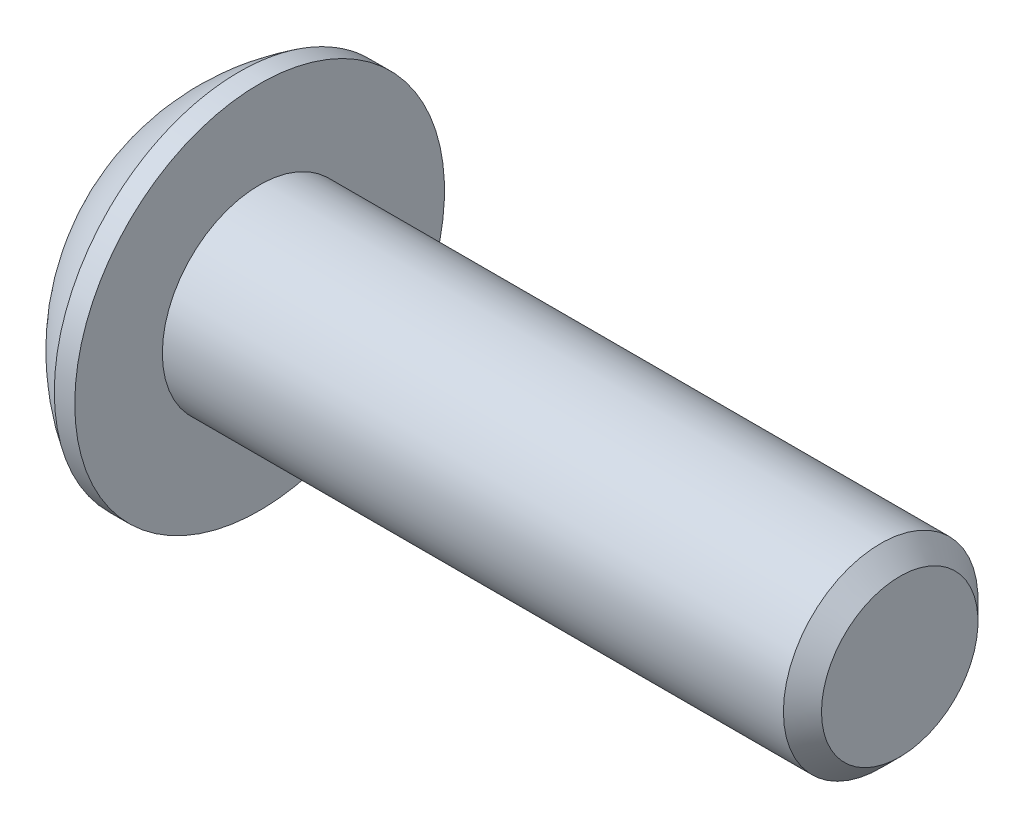
ISO-10303-21;
HEADER;
FILE_DESCRIPTION(('STEP AP214'),'2;1');
FILE_NAME('part.step','',(''),(''),'','','');
FILE_SCHEMA(('AUTOMOTIVE_DESIGN { 1 0 10303 214 1 1 1 1 }'));
ENDSEC;
DATA;
#1=APPLICATION_CONTEXT('core data for automotive mechanical design processes');
#2=APPLICATION_PROTOCOL_DEFINITION('international standard','automotive_design',2000,#1);
#3=PRODUCT_CONTEXT('',#1,'mechanical');
#4=PRODUCT('Part','Part','',(#3));
#5=PRODUCT_RELATED_PRODUCT_CATEGORY('part','',(#4));
#6=PRODUCT_DEFINITION_FORMATION('','',#4);
#7=PRODUCT_DEFINITION_CONTEXT('part definition',#1,'design');
#8=PRODUCT_DEFINITION('design','',#6,#7);
#9=PRODUCT_DEFINITION_SHAPE('','',#8);
#10=(LENGTH_UNIT() NAMED_UNIT(*) SI_UNIT(.MILLI.,.METRE.));
#11=(NAMED_UNIT(*) PLANE_ANGLE_UNIT() SI_UNIT($,.RADIAN.));
#12=(NAMED_UNIT(*) SI_UNIT($,.STERADIAN.) SOLID_ANGLE_UNIT());
#13=UNCERTAINTY_MEASURE_WITH_UNIT(LENGTH_MEASURE(1.E-05),#10,'distance_accuracy_value','');
#14=(GEOMETRIC_REPRESENTATION_CONTEXT(3) GLOBAL_UNCERTAINTY_ASSIGNED_CONTEXT((#13)) GLOBAL_UNIT_ASSIGNED_CONTEXT((#10,
#11,#12)) REPRESENTATION_CONTEXT('',''));
#15=CARTESIAN_POINT('',(0.,0.,0.));
#16=DIRECTION('',(0.,0.,1.));
#17=DIRECTION('',(1.,0.,0.));
#18=AXIS2_PLACEMENT_3D('',#15,#16,#17);
#19=CARTESIAN_POINT('',(1.77800000000006,0.,0.));
#20=DIRECTION('',(-1.,0.,0.));
#21=DIRECTION('',(0.,0.,1.));
#22=AXIS2_PLACEMENT_3D('',#19,#20,#21);
#23=CONICAL_SURFACE('',#22,1.58750000000007,1.04719755119647);
#24=CARTESIAN_POINT('',(2.69454355233878,0.,0.));
#25=VERTEX_POINT('',#24);
#26=VERTEX_LOOP('',#25);
#27=FACE_BOUND('',#26,.T.);
#28=CARTESIAN_POINT('',(1.77800000000006,0.,0.));
#29=DIRECTION('',(-1.,0.,0.));
#30=DIRECTION('',(0.,0.,1.));
#31=AXIS2_PLACEMENT_3D('',#28,#29,#30);
#32=CIRCLE('',#31,1.58750000000007);
#33=CARTESIAN_POINT('',(1.77800000000003,0.,1.58750000000004));
#34=VERTEX_POINT('',#33);
#35=CARTESIAN_POINT('',(1.77800000000003,-1.37481532850783,0.793750000000017));
#36=VERTEX_POINT('',#35);
#37=EDGE_CURVE('E19',#34,#36,#32,.F.);
#38=ORIENTED_EDGE('',*,*,#37,.F.);
#39=CARTESIAN_POINT('',(1.77800000000006,0.,0.));
#40=DIRECTION('',(-1.,0.,0.));
#41=DIRECTION('',(0.,0.,1.));
#42=AXIS2_PLACEMENT_3D('',#39,#40,#41);
#43=CIRCLE('',#42,1.58750000000007);
#44=CARTESIAN_POINT('',(1.77800000000003,1.37481532850783,0.793750000000019));
#45=VERTEX_POINT('',#44);
#46=EDGE_CURVE('E89',#34,#45,#43,.T.);
#47=ORIENTED_EDGE('',*,*,#46,.T.);
#48=CARTESIAN_POINT('',(1.77800000000006,0.,0.));
#49=DIRECTION('',(-1.,0.,0.));
#50=DIRECTION('',(0.,0.,1.));
#51=AXIS2_PLACEMENT_3D('',#48,#49,#50);
#52=CIRCLE('',#51,1.58750000000007);
#53=CARTESIAN_POINT('',(1.77800000000003,1.37481532850783,-0.793750000000019));
#54=VERTEX_POINT('',#53);
#55=EDGE_CURVE('E105',#45,#54,#52,.T.);
#56=ORIENTED_EDGE('',*,*,#55,.T.);
#57=CARTESIAN_POINT('',(1.77800000000006,0.,0.));
#58=DIRECTION('',(-1.,0.,0.));
#59=DIRECTION('',(0.,0.,1.));
#60=AXIS2_PLACEMENT_3D('',#57,#58,#59);
#61=CIRCLE('',#60,1.58750000000007);
#62=CARTESIAN_POINT('',(1.77800000000003,-2.78602967841758E-12,-1.58750000000004));
#63=VERTEX_POINT('',#62);
#64=EDGE_CURVE('E448',#54,#63,#61,.T.);
#65=ORIENTED_EDGE('',*,*,#64,.T.);
#66=CARTESIAN_POINT('',(1.77800000000006,0.,0.));
#67=DIRECTION('',(-1.,0.,0.));
#68=DIRECTION('',(0.,0.,1.));
#69=AXIS2_PLACEMENT_3D('',#66,#67,#68);
#70=CIRCLE('',#69,1.58750000000007);
#71=CARTESIAN_POINT('',(1.77800000000003,-1.37481532850783,-0.793750000000017));
#72=VERTEX_POINT('',#71);
#73=EDGE_CURVE('E450',#72,#63,#70,.F.);
#74=ORIENTED_EDGE('',*,*,#73,.F.);
#75=CARTESIAN_POINT('',(1.77800000000006,0.,0.));
#76=DIRECTION('',(-1.,0.,0.));
#77=DIRECTION('',(0.,0.,1.));
#78=AXIS2_PLACEMENT_3D('',#75,#76,#77);
#79=CIRCLE('',#78,1.58750000000007);
#80=EDGE_CURVE('E92',#36,#72,#79,.F.);
#81=ORIENTED_EDGE('',*,*,#80,.F.);
#82=EDGE_LOOP('',(#38,#47,#56,#65,#74,#81));
#83=FACE_BOUND('',#82,.T.);
#84=ADVANCED_FACE('F16',(#27,#83),#23,.F.);
#85=CARTESIAN_POINT('',(1.778,-2.74963065701559,-1.5875));
#86=DIRECTION('',(1.,0.,0.));
#87=DIRECTION('',(0.,0.,-1.));
#88=AXIS2_PLACEMENT_3D('',#85,#86,#87);
#89=PLANE('',#88);
#90=DIRECTION('',(0.,0.5,0.866025403784439));
#91=VECTOR('',#90,1.);
#92=CARTESIAN_POINT('',(1.778,-1.83308710467706,0.));
#93=LINE('',#92,#91);
#94=CARTESIAN_POINT('',(1.778,-0.91654355233853,1.5875));
#95=VERTEX_POINT('',#94);
#96=EDGE_CURVE('E110',#95,#36,#93,.F.);
#97=ORIENTED_EDGE('',*,*,#96,.F.);
#98=DIRECTION('',(0.,1.,0.));
#99=VECTOR('',#98,1.);
#100=CARTESIAN_POINT('',(1.778,-0.91654355233853,1.5875));
#101=LINE('',#100,#99);
#102=EDGE_CURVE('E108',#34,#95,#101,.F.);
#103=ORIENTED_EDGE('',*,*,#102,.F.);
#104=ORIENTED_EDGE('',*,*,#37,.T.);
#105=EDGE_LOOP('',(#97,#103,#104));
#106=FACE_BOUND('',#105,.T.);
#107=ADVANCED_FACE('F109',(#106),#89,.F.);
#108=CARTESIAN_POINT('',(1.778,-2.74963065701559,-1.5875));
#109=DIRECTION('',(1.,0.,0.));
#110=DIRECTION('',(0.,0.,-1.));
#111=AXIS2_PLACEMENT_3D('',#108,#109,#110);
#112=PLANE('',#111);
#113=DIRECTION('',(0.,-0.5,0.866025403784439));
#114=VECTOR('',#113,1.);
#115=CARTESIAN_POINT('',(1.778,-0.91654355233853,-1.5875));
#116=LINE('',#115,#114);
#117=CARTESIAN_POINT('',(1.778,-1.83308710467706,0.));
#118=VERTEX_POINT('',#117);
#119=EDGE_CURVE('E158',#118,#72,#116,.F.);
#120=ORIENTED_EDGE('',*,*,#119,.F.);
#121=DIRECTION('',(0.,0.5,0.866025403784439));
#122=VECTOR('',#121,1.);
#123=CARTESIAN_POINT('',(1.778,-1.83308710467706,0.));
#124=LINE('',#123,#122);
#125=EDGE_CURVE('E170',#36,#118,#124,.F.);
#126=ORIENTED_EDGE('',*,*,#125,.F.);
#127=ORIENTED_EDGE('',*,*,#80,.T.);
#128=EDGE_LOOP('',(#120,#126,#127));
#129=FACE_BOUND('',#128,.T.);
#130=ADVANCED_FACE('F247',(#129),#112,.F.);
#131=CARTESIAN_POINT('',(1.778,-2.74963065701559,-1.5875));
#132=DIRECTION('',(1.,0.,0.));
#133=DIRECTION('',(0.,0.,-1.));
#134=AXIS2_PLACEMENT_3D('',#131,#132,#133);
#135=PLANE('',#134);
#136=DIRECTION('',(0.,1.,0.));
#137=VECTOR('',#136,1.);
#138=CARTESIAN_POINT('',(1.778,0.916543552338532,-1.5875));
#139=LINE('',#138,#137);
#140=CARTESIAN_POINT('',(1.778,-0.91654355233853,-1.5875));
#141=VERTEX_POINT('',#140);
#142=EDGE_CURVE('E142',#141,#63,#139,.T.);
#143=ORIENTED_EDGE('',*,*,#142,.F.);
#144=DIRECTION('',(0.,-0.5,0.866025403784439));
#145=VECTOR('',#144,1.);
#146=CARTESIAN_POINT('',(1.778,-0.91654355233853,-1.5875));
#147=LINE('',#146,#145);
#148=EDGE_CURVE('E155',#72,#141,#147,.F.);
#149=ORIENTED_EDGE('',*,*,#148,.F.);
#150=ORIENTED_EDGE('',*,*,#73,.T.);
#151=EDGE_LOOP('',(#143,#149,#150));
#152=FACE_BOUND('',#151,.T.);
#153=ADVANCED_FACE('F243',(#152),#135,.F.);
#154=CARTESIAN_POINT('',(1.778,-2.74963065701559,-1.5875));
#155=DIRECTION('',(1.,0.,0.));
#156=DIRECTION('',(0.,0.,-1.));
#157=AXIS2_PLACEMENT_3D('',#154,#155,#156);
#158=PLANE('',#157);
#159=DIRECTION('',(0.,-0.5,-0.866025403784439));
#160=VECTOR('',#159,1.);
#161=CARTESIAN_POINT('',(1.778,1.83308710467706,0.));
#162=LINE('',#161,#160);
#163=CARTESIAN_POINT('',(1.778,0.916543552338532,-1.5875));
#164=VERTEX_POINT('',#163);
#165=EDGE_CURVE('E127',#164,#54,#162,.F.);
#166=ORIENTED_EDGE('',*,*,#165,.F.);
#167=DIRECTION('',(0.,1.,0.));
#168=VECTOR('',#167,1.);
#169=CARTESIAN_POINT('',(1.778,0.916543552338532,-1.5875));
#170=LINE('',#169,#168);
#171=EDGE_CURVE('E139',#63,#164,#170,.T.);
#172=ORIENTED_EDGE('',*,*,#171,.F.);
#173=ORIENTED_EDGE('',*,*,#64,.F.);
#174=EDGE_LOOP('',(#166,#172,#173));
#175=FACE_BOUND('',#174,.T.);
#176=ADVANCED_FACE('F239',(#175),#158,.F.);
#177=CARTESIAN_POINT('',(1.778,-2.74963065701559,-1.5875));
#178=DIRECTION('',(1.,0.,0.));
#179=DIRECTION('',(0.,0.,-1.));
#180=AXIS2_PLACEMENT_3D('',#177,#178,#179);
#181=PLANE('',#180);
#182=DIRECTION('',(0.,0.5,-0.866025403784439));
#183=VECTOR('',#182,1.);
#184=CARTESIAN_POINT('',(1.778,0.916543552338533,1.5875));
#185=LINE('',#184,#183);
#186=CARTESIAN_POINT('',(1.778,1.83308710467706,0.));
#187=VERTEX_POINT('',#186);
#188=EDGE_CURVE('E147',#187,#45,#185,.F.);
#189=ORIENTED_EDGE('',*,*,#188,.F.);
#190=DIRECTION('',(0.,-0.5,-0.866025403784439));
#191=VECTOR('',#190,1.);
#192=CARTESIAN_POINT('',(1.778,1.83308710467706,0.));
#193=LINE('',#192,#191);
#194=EDGE_CURVE('E124',#54,#187,#193,.F.);
#195=ORIENTED_EDGE('',*,*,#194,.F.);
#196=ORIENTED_EDGE('',*,*,#55,.F.);
#197=EDGE_LOOP('',(#189,#195,#196));
#198=FACE_BOUND('',#197,.T.);
#199=ADVANCED_FACE('F236',(#198),#181,.F.);
#200=CARTESIAN_POINT('',(1.778,-2.74963065701559,-1.5875));
#201=DIRECTION('',(1.,0.,0.));
#202=DIRECTION('',(0.,0.,-1.));
#203=AXIS2_PLACEMENT_3D('',#200,#201,#202);
#204=PLANE('',#203);
#205=DIRECTION('',(0.,1.,0.));
#206=VECTOR('',#205,1.);
#207=CARTESIAN_POINT('',(1.778,-0.91654355233853,1.5875));
#208=LINE('',#207,#206);
#209=CARTESIAN_POINT('',(1.778,0.916543552338533,1.5875));
#210=VERTEX_POINT('',#209);
#211=EDGE_CURVE('E100',#210,#34,#208,.F.);
#212=ORIENTED_EDGE('',*,*,#211,.F.);
#213=DIRECTION('',(0.,0.5,-0.866025403784439));
#214=VECTOR('',#213,1.);
#215=CARTESIAN_POINT('',(1.778,0.916543552338533,1.5875));
#216=LINE('',#215,#214);
#217=EDGE_CURVE('E103',#45,#210,#216,.F.);
#218=ORIENTED_EDGE('',*,*,#217,.F.);
#219=ORIENTED_EDGE('',*,*,#46,.F.);
#220=EDGE_LOOP('',(#212,#218,#219));
#221=FACE_BOUND('',#220,.T.);
#222=ADVANCED_FACE('F98',(#221),#204,.F.);
#223=CARTESIAN_POINT('',(1.778,-0.91654355233853,1.5875));
#224=DIRECTION('',(0.,0.,-1.));
#225=DIRECTION('',(0.,1.,0.));
#226=AXIS2_PLACEMENT_3D('',#223,#224,#225);
#227=PLANE('',#226);
#228=DIRECTION('',(0.,1.,0.));
#229=VECTOR('',#228,1.);
#230=CARTESIAN_POINT('',(0.,0.,1.5875));
#231=LINE('',#230,#229);
#232=CARTESIAN_POINT('',(0.,0.916543552338532,1.5875));
#233=VERTEX_POINT('',#232);
#234=CARTESIAN_POINT('',(0.,-0.91654355233853,1.5875));
#235=VERTEX_POINT('',#234);
#236=EDGE_CURVE('E131',#233,#235,#231,.F.);
#237=ORIENTED_EDGE('',*,*,#236,.F.);
#238=DIRECTION('',(1.,0.,0.));
#239=VECTOR('',#238,1.);
#240=CARTESIAN_POINT('',(1.778,0.916543552338533,1.5875));
#241=LINE('',#240,#239);
#242=EDGE_CURVE('E116',#210,#233,#241,.F.);
#243=ORIENTED_EDGE('',*,*,#242,.F.);
#244=ORIENTED_EDGE('',*,*,#211,.T.);
#245=ORIENTED_EDGE('',*,*,#102,.T.);
#246=DIRECTION('',(1.,0.,0.));
#247=VECTOR('',#246,1.);
#248=CARTESIAN_POINT('',(1.778,-0.91654355233853,1.5875));
#249=LINE('',#248,#247);
#250=EDGE_CURVE('E167',#235,#95,#249,.T.);
#251=ORIENTED_EDGE('',*,*,#250,.F.);
#252=EDGE_LOOP('',(#237,#243,#244,#245,#251));
#253=FACE_BOUND('',#252,.T.);
#254=ADVANCED_FACE('F114',(#253),#227,.T.);
#255=CARTESIAN_POINT('',(1.778,-1.83308710467706,0.));
#256=DIRECTION('',(0.,0.866025403784439,-0.5));
#257=DIRECTION('',(0.,0.5,0.866025403784439));
#258=AXIS2_PLACEMENT_3D('',#255,#256,#257);
#259=PLANE('',#258);
#260=DIRECTION('',(0.,-0.5,-0.866025403784439));
#261=VECTOR('',#260,1.);
#262=CARTESIAN_POINT('',(0.,-0.91654355233853,1.5875));
#263=LINE('',#262,#261);
#264=CARTESIAN_POINT('',(0.,-1.83308710467706,0.));
#265=VERTEX_POINT('',#264);
#266=EDGE_CURVE('E434',#235,#265,#263,.T.);
#267=ORIENTED_EDGE('',*,*,#266,.F.);
#268=ORIENTED_EDGE('',*,*,#250,.T.);
#269=ORIENTED_EDGE('',*,*,#96,.T.);
#270=ORIENTED_EDGE('',*,*,#125,.T.);
#271=DIRECTION('',(1.,0.,0.));
#272=VECTOR('',#271,1.);
#273=CARTESIAN_POINT('',(1.778,-1.83308710467706,0.));
#274=LINE('',#273,#272);
#275=EDGE_CURVE('E152',#265,#118,#274,.T.);
#276=ORIENTED_EDGE('',*,*,#275,.F.);
#277=EDGE_LOOP('',(#267,#268,#269,#270,#276));
#278=FACE_BOUND('',#277,.T.);
#279=ADVANCED_FACE('F227',(#278),#259,.T.);
#280=CARTESIAN_POINT('',(1.778,-0.91654355233853,-1.5875));
#281=DIRECTION('',(0.,0.866025403784439,0.5));
#282=DIRECTION('',(0.,-0.5,0.866025403784439));
#283=AXIS2_PLACEMENT_3D('',#280,#281,#282);
#284=PLANE('',#283);
#285=DIRECTION('',(0.,0.5,-0.866025403784439));
#286=VECTOR('',#285,1.);
#287=CARTESIAN_POINT('',(0.,-1.83308710467706,0.));
#288=LINE('',#287,#286);
#289=CARTESIAN_POINT('',(0.,-0.91654355233853,-1.5875));
#290=VERTEX_POINT('',#289);
#291=EDGE_CURVE('E431',#265,#290,#288,.T.);
#292=ORIENTED_EDGE('',*,*,#291,.F.);
#293=ORIENTED_EDGE('',*,*,#275,.T.);
#294=ORIENTED_EDGE('',*,*,#119,.T.);
#295=ORIENTED_EDGE('',*,*,#148,.T.);
#296=DIRECTION('',(1.,0.,0.));
#297=VECTOR('',#296,1.);
#298=CARTESIAN_POINT('',(1.778,-0.91654355233853,-1.5875));
#299=LINE('',#298,#297);
#300=EDGE_CURVE('E136',#290,#141,#299,.T.);
#301=ORIENTED_EDGE('',*,*,#300,.F.);
#302=EDGE_LOOP('',(#292,#293,#294,#295,#301));
#303=FACE_BOUND('',#302,.T.);
#304=ADVANCED_FACE('F223',(#303),#284,.T.);
#305=CARTESIAN_POINT('',(1.778,0.916543552338532,-1.5875));
#306=DIRECTION('',(0.,0.,1.));
#307=DIRECTION('',(1.,0.,0.));
#308=AXIS2_PLACEMENT_3D('',#305,#306,#307);
#309=PLANE('',#308);
#310=DIRECTION('',(0.,1.,0.));
#311=VECTOR('',#310,1.);
#312=CARTESIAN_POINT('',(0.,0.,-1.5875));
#313=LINE('',#312,#311);
#314=CARTESIAN_POINT('',(0.,0.916543552338532,-1.5875));
#315=VERTEX_POINT('',#314);
#316=EDGE_CURVE('E428',#290,#315,#313,.T.);
#317=ORIENTED_EDGE('',*,*,#316,.F.);
#318=ORIENTED_EDGE('',*,*,#300,.T.);
#319=ORIENTED_EDGE('',*,*,#142,.T.);
#320=ORIENTED_EDGE('',*,*,#171,.T.);
#321=DIRECTION('',(1.,0.,0.));
#322=VECTOR('',#321,1.);
#323=CARTESIAN_POINT('',(1.778,0.916543552338532,-1.5875));
#324=LINE('',#323,#322);
#325=EDGE_CURVE('E126',#315,#164,#324,.T.);
#326=ORIENTED_EDGE('',*,*,#325,.F.);
#327=EDGE_LOOP('',(#317,#318,#319,#320,#326));
#328=FACE_BOUND('',#327,.T.);
#329=ADVANCED_FACE('F220',(#328),#309,.T.);
#330=CARTESIAN_POINT('',(1.778,1.83308710467706,0.));
#331=DIRECTION('',(0.,-0.866025403784439,0.5));
#332=DIRECTION('',(0.,-0.5,-0.866025403784439));
#333=AXIS2_PLACEMENT_3D('',#330,#331,#332);
#334=PLANE('',#333);
#335=DIRECTION('',(0.,0.5,0.866025403784438));
#336=VECTOR('',#335,1.);
#337=CARTESIAN_POINT('',(0.,0.916543552338532,-1.5875));
#338=LINE('',#337,#336);
#339=CARTESIAN_POINT('',(0.,1.83308710467706,0.));
#340=VERTEX_POINT('',#339);
#341=EDGE_CURVE('E425',#315,#340,#338,.T.);
#342=ORIENTED_EDGE('',*,*,#341,.F.);
#343=ORIENTED_EDGE('',*,*,#325,.T.);
#344=ORIENTED_EDGE('',*,*,#165,.T.);
#345=ORIENTED_EDGE('',*,*,#194,.T.);
#346=DIRECTION('',(1.,0.,0.));
#347=VECTOR('',#346,1.);
#348=CARTESIAN_POINT('',(1.778,1.83308710467706,0.));
#349=LINE('',#348,#347);
#350=EDGE_CURVE('E34',#340,#187,#349,.T.);
#351=ORIENTED_EDGE('',*,*,#350,.F.);
#352=EDGE_LOOP('',(#342,#343,#344,#345,#351));
#353=FACE_BOUND('',#352,.T.);
#354=ADVANCED_FACE('F216',(#353),#334,.T.);
#355=CARTESIAN_POINT('',(1.778,0.916543552338533,1.5875));
#356=DIRECTION('',(0.,-0.866025403784439,-0.5));
#357=DIRECTION('',(0.,0.5,-0.866025403784439));
#358=AXIS2_PLACEMENT_3D('',#355,#356,#357);
#359=PLANE('',#358);
#360=DIRECTION('',(0.,-0.5,0.866025403784439));
#361=VECTOR('',#360,1.);
#362=CARTESIAN_POINT('',(0.,1.83308710467706,0.));
#363=LINE('',#362,#361);
#364=EDGE_CURVE('E202',#340,#233,#363,.T.);
#365=ORIENTED_EDGE('',*,*,#364,.F.);
#366=ORIENTED_EDGE('',*,*,#350,.T.);
#367=ORIENTED_EDGE('',*,*,#188,.T.);
#368=ORIENTED_EDGE('',*,*,#217,.T.);
#369=ORIENTED_EDGE('',*,*,#242,.T.);
#370=EDGE_LOOP('',(#365,#366,#367,#368,#369));
#371=FACE_BOUND('',#370,.T.);
#372=ADVANCED_FACE('F212',(#371),#359,.T.);
#373=CARTESIAN_POINT('',(0.,0.,0.));
#374=DIRECTION('',(-1.,0.,0.));
#375=DIRECTION('',(0.,0.,1.));
#376=AXIS2_PLACEMENT_3D('',#373,#374,#375);
#377=PLANE('',#376);
#378=ORIENTED_EDGE('',*,*,#341,.T.);
#379=ORIENTED_EDGE('',*,*,#364,.T.);
#380=ORIENTED_EDGE('',*,*,#236,.T.);
#381=ORIENTED_EDGE('',*,*,#266,.T.);
#382=ORIENTED_EDGE('',*,*,#291,.T.);
#383=ORIENTED_EDGE('',*,*,#316,.T.);
#384=EDGE_LOOP('',(#378,#379,#380,#381,#382,#383));
#385=FACE_BOUND('',#384,.T.);
#386=CARTESIAN_POINT('',(0.,2.29235,0.));
#387=CARTESIAN_POINT('',(0.,2.29234961429956,0.0643619991867155));
#388=CARTESIAN_POINT('',(0.,2.28963695190107,0.128735826629365));
#389=CARTESIAN_POINT('',(0.,2.27880393843647,0.257038618985286));
#390=CARTESIAN_POINT('',(0.,2.27068199085126,0.320967446929162));
#391=CARTESIAN_POINT('',(0.,2.24906694794255,0.448021254607717));
#392=CARTESIAN_POINT('',(-2.10840056970795E-13,2.2355653265346,0.51114479338186));
#393=CARTESIAN_POINT('',(2.11879226109671E-13,2.20328400495644,0.636065176149321));
#394=CARTESIAN_POINT('',(7.89917625163527E-13,2.18450002159113,0.697860899533934));
#395=CARTESIAN_POINT('',(1.31285126424162E-12,2.12048422735802,0.880329802927747));
#396=CARTESIAN_POINT('',(0.,2.06753599079459,0.998391795928116));
#397=CARTESIAN_POINT('',(0.,1.94254204858672,1.22393765942147));
#398=CARTESIAN_POINT('',(1.0943500696831E-12,1.87049561696642,1.33142112758208));
#399=CARTESIAN_POINT('',(6.78225420709987E-13,1.7497425419488,1.48237719670935));
#400=CARTESIAN_POINT('',(1.81996039545648E-13,1.707345731323,1.53101280076737));
#401=CARTESIAN_POINT('',(-1.80953624347813E-13,1.61863910291529,1.62450601319185));
#402=CARTESIAN_POINT('',(0.,1.57233309727312,1.66936721890417));
#403=CARTESIAN_POINT('',(0.,1.47608431707233,1.7550488420402));
#404=CARTESIAN_POINT('',(0.,1.42613990458994,1.79586741981512));
#405=CARTESIAN_POINT('',(0.,1.3229945254125,1.87315615311522));
#406=CARTESIAN_POINT('',(0.,1.26979280714187,1.90962529930697));
#407=CARTESIAN_POINT('',(0.,1.10588180153952,2.01207722151089));
#408=CARTESIAN_POINT('',(0.,0.990764947001307,2.07119486286666));
#409=CARTESIAN_POINT('',(0.,0.752302198839713,2.16922858468856));
#410=CARTESIAN_POINT('',(0.,0.628956393121256,2.20814488091449));
#411=CARTESIAN_POINT('',(0.,0.377466101733266,2.2647275576592));
#412=CARTESIAN_POINT('',(0.,0.249321590440377,2.28239382469379));
#413=CARTESIAN_POINT('',(0.,-0.00811435371610997,2.29595665980955));
#414=CARTESIAN_POINT('',(0.,-0.137405786579708,2.29185322789072));
#415=CARTESIAN_POINT('',(0.,-0.393449386933728,2.2620096240906));
#416=CARTESIAN_POINT('',(0.,-0.520201567981086,2.23626956775766));
#417=CARTESIAN_POINT('',(0.,-0.767645294384453,2.16383549332687));
#418=CARTESIAN_POINT('',(0.,-0.888336774993558,2.11714125142685));
#419=CARTESIAN_POINT('',(0.,-1.06210572146656,2.03247976453654));
#420=CARTESIAN_POINT('',(0.,-1.11884498714067,2.00180278323695));
#421=CARTESIAN_POINT('',(0.,-1.22954062855573,1.93578011658036));
#422=CARTESIAN_POINT('',(0.,-1.28349764565393,1.9004355139425));
#423=CARTESIAN_POINT('',(0.,-1.38821676641538,1.82534174602347));
#424=CARTESIAN_POINT('',(0.,-1.43898030563029,1.78559458231503));
#425=CARTESIAN_POINT('',(0.,-1.53701984534432,1.70193996292361));
#426=CARTESIAN_POINT('',(0.,-1.58429243280551,1.65802852924127));
#427=CARTESIAN_POINT('',(0.,-1.72023903553759,1.52059650554139));
#428=CARTESIAN_POINT('',(0.,-1.80318066138239,1.42127847626519));
#429=CARTESIAN_POINT('',(0.,-1.95118232345099,1.21011519784664));
#430=CARTESIAN_POINT('',(0.,-2.01624303935585,1.09827042509272));
#431=CARTESIAN_POINT('',(0.,-2.09907772661315,0.923538238005837));
#432=CARTESIAN_POINT('',(0.,-2.12425103063559,0.864058373981965));
#433=CARTESIAN_POINT('',(0.,-2.16947990046566,0.7432215621756));
#434=CARTESIAN_POINT('',(0.,-2.18953960800685,0.681866178863365));
#435=CARTESIAN_POINT('',(0.,-2.22438542051157,0.557786972400357));
#436=CARTESIAN_POINT('',(0.,-2.23917985294819,0.495065478128173));
#437=CARTESIAN_POINT('',(0.,-2.26343456384454,0.368611258323516));
#438=CARTESIAN_POINT('',(0.,-2.27289641559286,0.30487883675957));
#439=CARTESIAN_POINT('',(0.,-2.28388649696737,0.200873029360625));
#440=CARTESIAN_POINT('',(0.,-2.28705930623294,0.160766164180098));
#441=CARTESIAN_POINT('',(0.,-2.29129117827045,0.0804410725432715));
#442=CARTESIAN_POINT('',(0.,-2.29235024104239,0.0402228460869717));
#443=CARTESIAN_POINT('',(0.,-2.29234961429957,-0.0643619991867168));
#444=CARTESIAN_POINT('',(0.,-2.28963695190109,-0.128735826629366));
#445=CARTESIAN_POINT('',(0.,-2.27880393843648,-0.257038618985287));
#446=CARTESIAN_POINT('',(0.,-2.27068199085127,-0.320967446929163));
#447=CARTESIAN_POINT('',(0.,-2.24906694794256,-0.448021254607718));
#448=CARTESIAN_POINT('',(-2.11158505516439E-13,-2.23556532653461,-0.511144793381861));
#449=CARTESIAN_POINT('',(2.12197933617066E-13,-2.20328400495644,-0.636065176149321));
#450=CARTESIAN_POINT('',(7.91271169771705E-13,-2.18450002159114,-0.697860899533935));
#451=CARTESIAN_POINT('',(1.31534652841856E-12,-2.12048422735803,-0.880329802927748));
#452=CARTESIAN_POINT('',(0.,-2.06753599079459,-0.998391795928114));
#453=CARTESIAN_POINT('',(0.,-1.94254204858673,-1.22393765942147));
#454=CARTESIAN_POINT('',(1.09423089153949E-12,-1.87049561696643,-1.33142112758208));
#455=CARTESIAN_POINT('',(6.78285087865736E-13,-1.74974254194881,-1.48237719670935));
#456=CARTESIAN_POINT('',(1.82011279261461E-13,-1.70734573132301,-1.53101280076737));
#457=CARTESIAN_POINT('',(-1.80968849370244E-13,-1.61863910291529,-1.62450601319185));
#458=CARTESIAN_POINT('',(0.,-1.57233309727313,-1.66936721890417));
#459=CARTESIAN_POINT('',(0.,-1.47608431707234,-1.7550488420402));
#460=CARTESIAN_POINT('',(0.,-1.42613990458995,-1.79586741981512));
#461=CARTESIAN_POINT('',(0.,-1.32299452541251,-1.87315615311522));
#462=CARTESIAN_POINT('',(0.,-1.26979280714188,-1.90962529930696));
#463=CARTESIAN_POINT('',(0.,-1.10588180153952,-2.01207722151089));
#464=CARTESIAN_POINT('',(0.,-0.990764947001314,-2.07119486286666));
#465=CARTESIAN_POINT('',(0.,-0.752302198839721,-2.16922858468856));
#466=CARTESIAN_POINT('',(0.,-0.628956393121265,-2.2081448809145));
#467=CARTESIAN_POINT('',(0.,-0.377466101733274,-2.2647275576592));
#468=CARTESIAN_POINT('',(0.,-0.249321590440385,-2.28239382469379));
#469=CARTESIAN_POINT('',(0.,0.0081143537161019,-2.29595665980955));
#470=CARTESIAN_POINT('',(0.,0.1374057865797,-2.29185322789072));
#471=CARTESIAN_POINT('',(0.,0.39344938693372,-2.2620096240906));
#472=CARTESIAN_POINT('',(0.,0.520201567981077,-2.23626956775766));
#473=CARTESIAN_POINT('',(0.,0.767645294384445,-2.16383549332687));
#474=CARTESIAN_POINT('',(0.,0.88833677499355,-2.11714125142685));
#475=CARTESIAN_POINT('',(0.,1.06210572146656,-2.03247976453654));
#476=CARTESIAN_POINT('',(0.,1.11884498714066,-2.00180278323695));
#477=CARTESIAN_POINT('',(0.,1.22954062855572,-1.93578011658036));
#478=CARTESIAN_POINT('',(0.,1.28349764565392,-1.9004355139425));
#479=CARTESIAN_POINT('',(0.,1.38821676641537,-1.82534174602348));
#480=CARTESIAN_POINT('',(0.,1.43898030563028,-1.78559458231503));
#481=CARTESIAN_POINT('',(0.,1.53701984534431,-1.70193996292361));
#482=CARTESIAN_POINT('',(0.,1.5842924328055,-1.65802852924127));
#483=CARTESIAN_POINT('',(0.,1.72023903553758,-1.52059650554139));
#484=CARTESIAN_POINT('',(0.,1.80318066138238,-1.42127847626519));
#485=CARTESIAN_POINT('',(0.,1.95118232345098,-1.21011519784664));
#486=CARTESIAN_POINT('',(0.,2.01624303935584,-1.09827042509272));
#487=CARTESIAN_POINT('',(0.,2.09907772661315,-0.923538238005838));
#488=CARTESIAN_POINT('',(0.,2.12425103063558,-0.864058373981966));
#489=CARTESIAN_POINT('',(0.,2.16947990046565,-0.7432215621756));
#490=CARTESIAN_POINT('',(0.,2.18953960800684,-0.681866178863365));
#491=CARTESIAN_POINT('',(0.,2.22438542051156,-0.557786972400357));
#492=CARTESIAN_POINT('',(0.,2.23917985294818,-0.495065478128172));
#493=CARTESIAN_POINT('',(0.,2.26343456384453,-0.368611258323515));
#494=CARTESIAN_POINT('',(0.,2.27289641559286,-0.304878836759569));
#495=CARTESIAN_POINT('',(0.,2.28388649696736,-0.200873029360625));
#496=CARTESIAN_POINT('',(0.,2.28705930623293,-0.160766164180098));
#497=CARTESIAN_POINT('',(0.,2.29129117827044,-0.0804410725432719));
#498=CARTESIAN_POINT('',(0.,2.29235024104238,-0.0402228460869725));
#499=CARTESIAN_POINT('',(0.,2.29235,0.));
#500=B_SPLINE_CURVE_WITH_KNOTS('',3,(#386,#387,#388,#389,#390,#391,#392,#393,#394,#395,#396,
#397,#398,#399,#400,#401,#402,#403,#404,#405,#406,#407,#408,#409,#410,#411,#412,#413,#414,#415,
#416,#417,#418,#419,#420,#421,#422,#423,#424,#425,#426,#427,#428,#429,#430,#431,#432,#433,#434,
#435,#436,#437,#438,#439,#440,#441,#442,#443,#444,#445,#446,#447,#448,#449,#450,#451,#452,#453,
#454,#455,#456,#457,#458,#459,#460,#461,#462,#463,#464,#465,#466,#467,#468,#469,#470,#471,#472,
#473,#474,#475,#476,#477,#478,#479,#480,#481,#482,#483,#484,#485,#486,#487,#488,#489,#490,#491,
#492,#493,#494,#495,#496,#497,#498,#499),.UNSPECIFIED.,.T.,.F.,(4,2,2,2,2,2,2,2,2,2,2,2,2,2,2,2,
2,2,2,2,2,2,2,2,2,2,2,2,2,2,2,2,2,2,2,2,2,2,2,2,2,2,2,2,2,2,2,2,2,2,2,2,2,2,2,2,4),(0.,
0.193048968618033,0.386154939782395,0.579568183995958,0.773138711491038,1.15935703864577,
1.54559004914645,1.73895960916368,1.93214273180063,2.12541336477221,2.31872876140888,
2.70495649282618,3.09118009906583,3.47740576789431,3.86363143672285,4.24985504296253,
4.63608277437979,4.82939817101619,5.02266880398748,5.2158519266242,5.40922148664122,
5.79545449714217,6.18167282429724,6.37524335179261,6.56865659600641,6.76176256717089,
6.95481153578908,7.07545693291922,7.19610233004937,7.3891512986674,7.58225726983176,
7.77567051404533,7.96924104154041,8.35545936869514,8.74169237919581,8.93506193921305,
9.12824506185,9.32151569482158,9.51483109145825,9.90105882287555,10.2872824291152,
10.6735080979437,11.0597337667722,11.4459573730119,11.8321851044292,12.0255005010656,
12.2187711340368,12.4119542566736,12.6053238166906,12.9915568271915,13.3777751543466,
13.571345681842,13.7647589260558,13.9578648972203,14.1509138658384,14.2715592629686,
14.3922046600987),.UNSPECIFIED.);
#501=CARTESIAN_POINT('',(0.,2.29235,0.));
#502=VERTEX_POINT('',#501);
#503=EDGE_CURVE('E196',#502,#502,#500,.T.);
#504=ORIENTED_EDGE('',*,*,#503,.F.);
#505=EDGE_LOOP('',(#504));
#506=FACE_BOUND('',#505,.T.);
#507=ADVANCED_FACE('F208',(#385,#506),#377,.T.);
#508=CARTESIAN_POINT('',(4.85989606481482,0.,0.));
#509=DIRECTION('',(0.,1.,0.));
#510=DIRECTION('',(1.,0.,0.));
#511=AXIS2_PLACEMENT_3D('',#508,#509,#510);
#512=SPHERICAL_SURFACE('',#511,5.37340285883187);
#513=CARTESIAN_POINT('',(2.0574,0.,0.));
#514=DIRECTION('',(-1.,0.,0.));
#515=DIRECTION('',(0.,0.,1.));
#516=AXIS2_PLACEMENT_3D('',#513,#514,#515);
#517=CIRCLE('',#516,4.5847);
#518=CARTESIAN_POINT('',(2.0574,0.,4.5847));
#519=VERTEX_POINT('',#518);
#520=EDGE_CURVE('E193',#519,#519,#517,.F.);
#521=ORIENTED_EDGE('',*,*,#520,.F.);
#522=EDGE_LOOP('',(#521));
#523=FACE_BOUND('',#522,.T.);
#524=ORIENTED_EDGE('',*,*,#503,.T.);
#525=EDGE_LOOP('',(#524));
#526=FACE_BOUND('',#525,.T.);
#527=ADVANCED_FACE('F204',(#523,#526),#512,.T.);
#528=CARTESIAN_POINT('',(18.4404,0.,0.));
#529=DIRECTION('',(-1.,0.,0.));
#530=DIRECTION('',(0.,0.,1.));
#531=AXIS2_PLACEMENT_3D('',#528,#529,#530);
#532=PLANE('',#531);
#533=CARTESIAN_POINT('',(18.4403999999176,0.,0.));
#534=DIRECTION('',(-1.,0.,0.));
#535=DIRECTION('',(0.,0.,1.));
#536=AXIS2_PLACEMENT_3D('',#533,#534,#535);
#537=CIRCLE('',#536,1.94055999998);
#538=CARTESIAN_POINT('',(18.4403999999176,0.,1.94055999998));
#539=VERTEX_POINT('',#538);
#540=EDGE_CURVE('E190',#539,#539,#537,.T.);
#541=ORIENTED_EDGE('',*,*,#540,.F.);
#542=EDGE_LOOP('',(#541));
#543=FACE_BOUND('',#542,.T.);
#544=ADVANCED_FACE('F275',(#543),#532,.F.);
#545=CARTESIAN_POINT('',(0.,0.,0.));
#546=DIRECTION('',(-1.,0.,0.));
#547=DIRECTION('',(0.,0.,1.));
#548=AXIS2_PLACEMENT_3D('',#545,#546,#547);
#549=CYLINDRICAL_SURFACE('',#548,4.5847);
#550=ORIENTED_EDGE('',*,*,#520,.T.);
#551=EDGE_LOOP('',(#550));
#552=FACE_BOUND('',#551,.T.);
#553=CARTESIAN_POINT('',(2.5654,0.,0.));
#554=DIRECTION('',(-1.,0.,0.));
#555=DIRECTION('',(0.,0.,1.));
#556=AXIS2_PLACEMENT_3D('',#553,#554,#555);
#557=CIRCLE('',#556,4.5847);
#558=CARTESIAN_POINT('',(2.5654,0.,4.5847));
#559=VERTEX_POINT('',#558);
#560=EDGE_CURVE('E187',#559,#559,#557,.T.);
#561=ORIENTED_EDGE('',*,*,#560,.T.);
#562=EDGE_LOOP('',(#561));
#563=FACE_BOUND('',#562,.T.);
#564=ADVANCED_FACE('F272',(#552,#563),#549,.T.);
#565=CARTESIAN_POINT('',(17.9679599999645,0.,0.));
#566=DIRECTION('',(-1.,0.,0.));
#567=DIRECTION('',(0.,0.,1.));
#568=AXIS2_PLACEMENT_3D('',#565,#566,#567);
#569=CONICAL_SURFACE('',#568,2.41299999993316,0.785398163397448);
#570=CARTESIAN_POINT('',(17.96796,0.,0.));
#571=DIRECTION('',(-1.,0.,0.));
#572=DIRECTION('',(0.,0.,1.));
#573=AXIS2_PLACEMENT_3D('',#570,#571,#572);
#574=CIRCLE('',#573,2.413);
#575=CARTESIAN_POINT('',(17.96796,0.,2.413));
#576=VERTEX_POINT('',#575);
#577=EDGE_CURVE('E25',#576,#576,#574,.T.);
#578=ORIENTED_EDGE('',*,*,#577,.F.);
#579=EDGE_LOOP('',(#578));
#580=FACE_BOUND('',#579,.T.);
#581=ORIENTED_EDGE('',*,*,#540,.T.);
#582=EDGE_LOOP('',(#581));
#583=FACE_BOUND('',#582,.T.);
#584=ADVANCED_FACE('F265',(#580,#583),#569,.T.);
#585=CARTESIAN_POINT('',(2.5654,2.41299999999999,0.));
#586=DIRECTION('',(-1.,0.,0.));
#587=DIRECTION('',(0.,0.,1.));
#588=AXIS2_PLACEMENT_3D('',#585,#586,#587);
#589=PLANE('',#588);
#590=CARTESIAN_POINT('',(2.5654,0.,0.));
#591=DIRECTION('',(-1.,0.,0.));
#592=DIRECTION('',(0.,0.,1.));
#593=AXIS2_PLACEMENT_3D('',#590,#591,#592);
#594=CIRCLE('',#593,2.413);
#595=CARTESIAN_POINT('',(2.5654,0.,2.413));
#596=VERTEX_POINT('',#595);
#597=EDGE_CURVE('E11',#596,#596,#594,.F.);
#598=ORIENTED_EDGE('',*,*,#597,.F.);
#599=EDGE_LOOP('',(#598));
#600=FACE_BOUND('',#599,.T.);
#601=ORIENTED_EDGE('',*,*,#560,.F.);
#602=EDGE_LOOP('',(#601));
#603=FACE_BOUND('',#602,.T.);
#604=ADVANCED_FACE('F259',(#600,#603),#589,.F.);
#605=CARTESIAN_POINT('',(0.,0.,0.));
#606=DIRECTION('',(-1.,0.,0.));
#607=DIRECTION('',(0.,0.,1.));
#608=AXIS2_PLACEMENT_3D('',#605,#606,#607);
#609=CYLINDRICAL_SURFACE('',#608,2.413);
#610=ORIENTED_EDGE('',*,*,#597,.T.);
#611=EDGE_LOOP('',(#610));
#612=FACE_BOUND('',#611,.T.);
#613=ORIENTED_EDGE('',*,*,#577,.T.);
#614=EDGE_LOOP('',(#613));
#615=FACE_BOUND('',#614,.T.);
#616=ADVANCED_FACE('F257',(#612,#615),#609,.T.);
#617=CLOSED_SHELL('',(#84,#107,#130,#153,#176,#199,#222,#254,#279,#304,#329,#354,#372,#507,#527,
#544,#564,#584,#604,#616));
#618=MANIFOLD_SOLID_BREP('B1',#617);
#619=ADVANCED_BREP_SHAPE_REPRESENTATION('',(#18,#618),#14);
#620=SHAPE_DEFINITION_REPRESENTATION(#9,#619);
ENDSEC;
END-ISO-10303-21;
